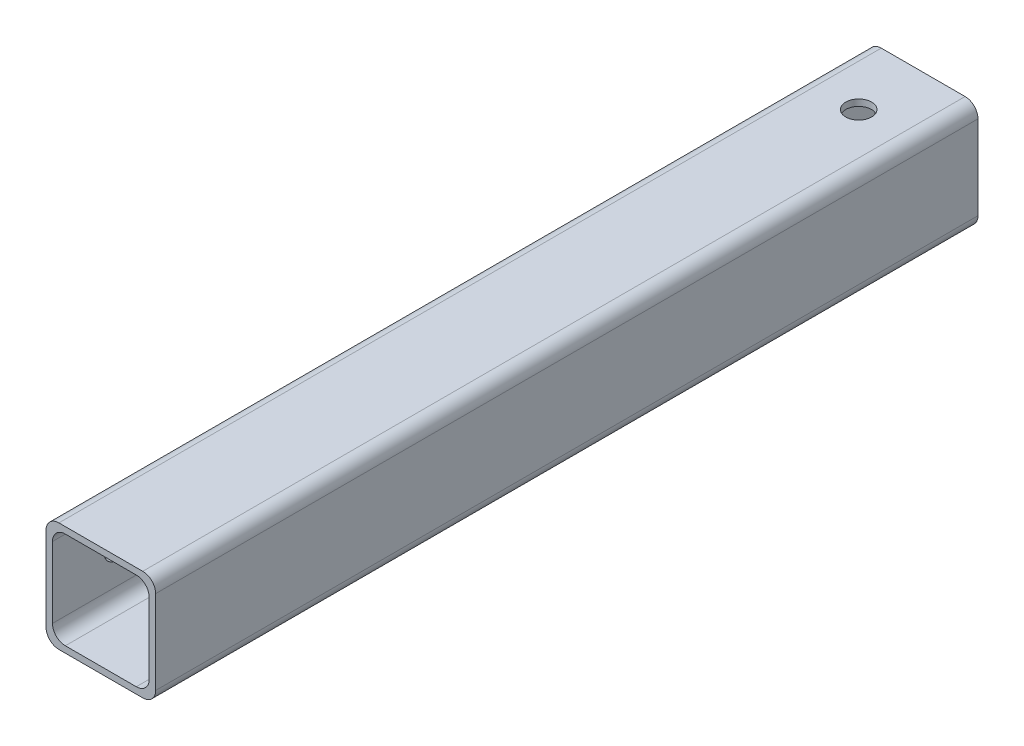
ISO-10303-21;
HEADER;
FILE_DESCRIPTION(('STEP AP214'),'2;1');
FILE_NAME('part.step','',(''),(''),'','','');
FILE_SCHEMA(('AUTOMOTIVE_DESIGN { 1 0 10303 214 1 1 1 1 }'));
ENDSEC;
DATA;
#1=APPLICATION_CONTEXT('core data for automotive mechanical design processes');
#2=APPLICATION_PROTOCOL_DEFINITION('international standard','automotive_design',2000,#1);
#3=PRODUCT_CONTEXT('',#1,'mechanical');
#4=PRODUCT('Part','Part','',(#3));
#5=PRODUCT_RELATED_PRODUCT_CATEGORY('part','',(#4));
#6=PRODUCT_DEFINITION_FORMATION('','',#4);
#7=PRODUCT_DEFINITION_CONTEXT('part definition',#1,'design');
#8=PRODUCT_DEFINITION('design','',#6,#7);
#9=PRODUCT_DEFINITION_SHAPE('','',#8);
#10=(LENGTH_UNIT() NAMED_UNIT(*) SI_UNIT(.MILLI.,.METRE.));
#11=(NAMED_UNIT(*) PLANE_ANGLE_UNIT() SI_UNIT($,.RADIAN.));
#12=(NAMED_UNIT(*) SI_UNIT($,.STERADIAN.) SOLID_ANGLE_UNIT());
#13=UNCERTAINTY_MEASURE_WITH_UNIT(LENGTH_MEASURE(1.E-05),#10,'distance_accuracy_value','');
#14=(GEOMETRIC_REPRESENTATION_CONTEXT(3) GLOBAL_UNCERTAINTY_ASSIGNED_CONTEXT((#13)) GLOBAL_UNIT_ASSIGNED_CONTEXT((#10,
#11,#12)) REPRESENTATION_CONTEXT('',''));
#15=CARTESIAN_POINT('',(0.,0.,0.));
#16=DIRECTION('',(0.,0.,1.));
#17=DIRECTION('',(1.,0.,0.));
#18=AXIS2_PLACEMENT_3D('',#15,#16,#17);
#19=CARTESIAN_POINT('',(0.,0.,161.925));
#20=DIRECTION('',(0.,0.,1.));
#21=DIRECTION('',(1.,0.,0.));
#22=AXIS2_PLACEMENT_3D('',#19,#20,#21);
#23=PLANE('',#22);
#24=DIRECTION('',(0.,1.,0.));
#25=VECTOR('',#24,1.);
#26=CARTESIAN_POINT('',(10.795,-10.795,161.925));
#27=LINE('',#26,#25);
#28=CARTESIAN_POINT('',(10.795,-8.255,161.925));
#29=VERTEX_POINT('',#28);
#30=CARTESIAN_POINT('',(10.795,8.255,161.925));
#31=VERTEX_POINT('',#30);
#32=EDGE_CURVE('E180',#29,#31,#27,.T.);
#33=ORIENTED_EDGE('',*,*,#32,.T.);
#34=CARTESIAN_POINT('',(8.255,8.255,161.925));
#35=DIRECTION('',(0.,0.,1.));
#36=DIRECTION('',(1.,0.,0.));
#37=AXIS2_PLACEMENT_3D('',#34,#35,#36);
#38=CIRCLE('',#37,2.54);
#39=CARTESIAN_POINT('',(8.255,10.795,161.925));
#40=VERTEX_POINT('',#39);
#41=EDGE_CURVE('E222',#31,#40,#38,.T.);
#42=ORIENTED_EDGE('',*,*,#41,.T.);
#43=DIRECTION('',(-1.,0.,0.));
#44=VECTOR('',#43,1.);
#45=CARTESIAN_POINT('',(10.795,10.795,161.925));
#46=LINE('',#45,#44);
#47=CARTESIAN_POINT('',(-8.255,10.795,161.925));
#48=VERTEX_POINT('',#47);
#49=EDGE_CURVE('E175',#40,#48,#46,.T.);
#50=ORIENTED_EDGE('',*,*,#49,.T.);
#51=CARTESIAN_POINT('',(-8.255,8.255,161.925));
#52=DIRECTION('',(0.,0.,1.));
#53=DIRECTION('',(1.,0.,0.));
#54=AXIS2_PLACEMENT_3D('',#51,#52,#53);
#55=CIRCLE('',#54,2.54);
#56=CARTESIAN_POINT('',(-10.795,8.255,161.925));
#57=VERTEX_POINT('',#56);
#58=EDGE_CURVE('E217',#48,#57,#55,.T.);
#59=ORIENTED_EDGE('',*,*,#58,.T.);
#60=DIRECTION('',(0.,-1.,0.));
#61=VECTOR('',#60,1.);
#62=CARTESIAN_POINT('',(-10.795,-10.795,161.925));
#63=LINE('',#62,#61);
#64=CARTESIAN_POINT('',(-10.795,-8.25500000000001,161.925));
#65=VERTEX_POINT('',#64);
#66=EDGE_CURVE('E277',#57,#65,#63,.T.);
#67=ORIENTED_EDGE('',*,*,#66,.T.);
#68=CARTESIAN_POINT('',(-8.255,-8.25500000000001,161.925));
#69=DIRECTION('',(0.,0.,1.));
#70=DIRECTION('',(1.,0.,0.));
#71=AXIS2_PLACEMENT_3D('',#68,#69,#70);
#72=CIRCLE('',#71,2.54);
#73=CARTESIAN_POINT('',(-8.255,-10.795,161.925));
#74=VERTEX_POINT('',#73);
#75=EDGE_CURVE('E57',#65,#74,#72,.T.);
#76=ORIENTED_EDGE('',*,*,#75,.T.);
#77=DIRECTION('',(1.,0.,0.));
#78=VECTOR('',#77,1.);
#79=CARTESIAN_POINT('',(10.795,-10.795,161.925));
#80=LINE('',#79,#78);
#81=CARTESIAN_POINT('',(8.255,-10.795,161.925));
#82=VERTEX_POINT('',#81);
#83=EDGE_CURVE('E279',#74,#82,#80,.T.);
#84=ORIENTED_EDGE('',*,*,#83,.T.);
#85=CARTESIAN_POINT('',(8.255,-8.255,161.925));
#86=DIRECTION('',(0.,0.,1.));
#87=DIRECTION('',(1.,0.,0.));
#88=AXIS2_PLACEMENT_3D('',#85,#86,#87);
#89=CIRCLE('',#88,2.54);
#90=EDGE_CURVE('E220',#82,#29,#89,.T.);
#91=ORIENTED_EDGE('',*,*,#90,.T.);
#92=EDGE_LOOP('',(#33,#42,#50,#59,#67,#76,#84,#91));
#93=FACE_BOUND('',#92,.T.);
#94=DIRECTION('',(1.,0.,0.));
#95=VECTOR('',#94,1.);
#96=CARTESIAN_POINT('',(9.525,-9.525,161.925));
#97=LINE('',#96,#95);
#98=CARTESIAN_POINT('',(-6.985,-9.525,161.925));
#99=VERTEX_POINT('',#98);
#100=CARTESIAN_POINT('',(6.985,-9.525,161.925));
#101=VERTEX_POINT('',#100);
#102=EDGE_CURVE('E259',#99,#101,#97,.T.);
#103=ORIENTED_EDGE('',*,*,#102,.F.);
#104=CARTESIAN_POINT('',(-6.985,-6.985,161.925));
#105=DIRECTION('',(0.,0.,1.));
#106=DIRECTION('',(1.,0.,0.));
#107=AXIS2_PLACEMENT_3D('',#104,#105,#106);
#108=CIRCLE('',#107,2.54);
#109=CARTESIAN_POINT('',(-9.525,-6.985,161.925));
#110=VERTEX_POINT('',#109);
#111=EDGE_CURVE('E160',#99,#110,#108,.F.);
#112=ORIENTED_EDGE('',*,*,#111,.T.);
#113=DIRECTION('',(0.,-1.,0.));
#114=VECTOR('',#113,1.);
#115=CARTESIAN_POINT('',(-9.525,-9.525,161.925));
#116=LINE('',#115,#114);
#117=CARTESIAN_POINT('',(-9.525,6.98499999999999,161.925));
#118=VERTEX_POINT('',#117);
#119=EDGE_CURVE('E265',#118,#110,#116,.T.);
#120=ORIENTED_EDGE('',*,*,#119,.F.);
#121=CARTESIAN_POINT('',(-6.985,6.985,161.925));
#122=DIRECTION('',(0.,0.,1.));
#123=DIRECTION('',(1.,0.,0.));
#124=AXIS2_PLACEMENT_3D('',#121,#122,#123);
#125=CIRCLE('',#124,2.54);
#126=CARTESIAN_POINT('',(-6.985,9.525,161.925));
#127=VERTEX_POINT('',#126);
#128=EDGE_CURVE('E159',#118,#127,#125,.F.);
#129=ORIENTED_EDGE('',*,*,#128,.T.);
#130=DIRECTION('',(-1.,0.,0.));
#131=VECTOR('',#130,1.);
#132=CARTESIAN_POINT('',(9.525,9.525,161.925));
#133=LINE('',#132,#131);
#134=CARTESIAN_POINT('',(6.985,9.525,161.925));
#135=VERTEX_POINT('',#134);
#136=EDGE_CURVE('E267',#135,#127,#133,.T.);
#137=ORIENTED_EDGE('',*,*,#136,.F.);
#138=CARTESIAN_POINT('',(6.985,6.98499999999999,161.925));
#139=DIRECTION('',(0.,0.,1.));
#140=DIRECTION('',(1.,0.,0.));
#141=AXIS2_PLACEMENT_3D('',#138,#139,#140);
#142=CIRCLE('',#141,2.54);
#143=CARTESIAN_POINT('',(9.525,6.98499999999999,161.925));
#144=VERTEX_POINT('',#143);
#145=EDGE_CURVE('E239',#135,#144,#142,.F.);
#146=ORIENTED_EDGE('',*,*,#145,.T.);
#147=DIRECTION('',(0.,1.,0.));
#148=VECTOR('',#147,1.);
#149=CARTESIAN_POINT('',(9.525,-9.525,161.925));
#150=LINE('',#149,#148);
#151=CARTESIAN_POINT('',(9.525,-6.985,161.925));
#152=VERTEX_POINT('',#151);
#153=EDGE_CURVE('E261',#152,#144,#150,.T.);
#154=ORIENTED_EDGE('',*,*,#153,.F.);
#155=CARTESIAN_POINT('',(6.985,-6.985,161.925));
#156=DIRECTION('',(0.,0.,1.));
#157=DIRECTION('',(1.,0.,0.));
#158=AXIS2_PLACEMENT_3D('',#155,#156,#157);
#159=CIRCLE('',#158,2.54);
#160=EDGE_CURVE('E11',#152,#101,#159,.F.);
#161=ORIENTED_EDGE('',*,*,#160,.T.);
#162=EDGE_LOOP('',(#103,#112,#120,#129,#137,#146,#154,#161));
#163=FACE_BOUND('',#162,.T.);
#164=ADVANCED_FACE('F35',(#93,#163),#23,.T.);
#165=CARTESIAN_POINT('',(0.,0.,0.));
#166=DIRECTION('',(0.,0.,1.));
#167=DIRECTION('',(1.,0.,0.));
#168=AXIS2_PLACEMENT_3D('',#165,#166,#167);
#169=PLANE('',#168);
#170=DIRECTION('',(-1.,0.,0.));
#171=VECTOR('',#170,1.);
#172=CARTESIAN_POINT('',(10.795,10.795,0.));
#173=LINE('',#172,#171);
#174=CARTESIAN_POINT('',(8.255,10.795,0.));
#175=VERTEX_POINT('',#174);
#176=CARTESIAN_POINT('',(-8.255,10.795,0.));
#177=VERTEX_POINT('',#176);
#178=EDGE_CURVE('E183',#175,#177,#173,.T.);
#179=ORIENTED_EDGE('',*,*,#178,.F.);
#180=CARTESIAN_POINT('',(8.255,8.255,0.));
#181=DIRECTION('',(0.,0.,1.));
#182=DIRECTION('',(1.,0.,0.));
#183=AXIS2_PLACEMENT_3D('',#180,#181,#182);
#184=CIRCLE('',#183,2.54);
#185=CARTESIAN_POINT('',(10.795,8.255,0.));
#186=VERTEX_POINT('',#185);
#187=EDGE_CURVE('E210',#175,#186,#184,.F.);
#188=ORIENTED_EDGE('',*,*,#187,.T.);
#189=DIRECTION('',(0.,1.,0.));
#190=VECTOR('',#189,1.);
#191=CARTESIAN_POINT('',(10.795,-10.795,0.));
#192=LINE('',#191,#190);
#193=CARTESIAN_POINT('',(10.795,-8.255,0.));
#194=VERTEX_POINT('',#193);
#195=EDGE_CURVE('E286',#194,#186,#192,.T.);
#196=ORIENTED_EDGE('',*,*,#195,.F.);
#197=CARTESIAN_POINT('',(8.255,-8.255,0.));
#198=DIRECTION('',(0.,0.,1.));
#199=DIRECTION('',(1.,0.,0.));
#200=AXIS2_PLACEMENT_3D('',#197,#198,#199);
#201=CIRCLE('',#200,2.54);
#202=CARTESIAN_POINT('',(8.255,-10.795,0.));
#203=VERTEX_POINT('',#202);
#204=EDGE_CURVE('E208',#194,#203,#201,.F.);
#205=ORIENTED_EDGE('',*,*,#204,.T.);
#206=DIRECTION('',(1.,0.,0.));
#207=VECTOR('',#206,1.);
#208=CARTESIAN_POINT('',(10.795,-10.795,0.));
#209=LINE('',#208,#207);
#210=CARTESIAN_POINT('',(-8.255,-10.795,0.));
#211=VERTEX_POINT('',#210);
#212=EDGE_CURVE('E285',#211,#203,#209,.T.);
#213=ORIENTED_EDGE('',*,*,#212,.F.);
#214=CARTESIAN_POINT('',(-8.255,-8.25500000000001,0.));
#215=DIRECTION('',(0.,0.,1.));
#216=DIRECTION('',(1.,0.,0.));
#217=AXIS2_PLACEMENT_3D('',#214,#215,#216);
#218=CIRCLE('',#217,2.54);
#219=CARTESIAN_POINT('',(-10.795,-8.25500000000001,0.));
#220=VERTEX_POINT('',#219);
#221=EDGE_CURVE('E206',#211,#220,#218,.F.);
#222=ORIENTED_EDGE('',*,*,#221,.T.);
#223=DIRECTION('',(0.,-1.,0.));
#224=VECTOR('',#223,1.);
#225=CARTESIAN_POINT('',(-10.795,-10.795,0.));
#226=LINE('',#225,#224);
#227=CARTESIAN_POINT('',(-10.795,8.255,0.));
#228=VERTEX_POINT('',#227);
#229=EDGE_CURVE('E273',#228,#220,#226,.T.);
#230=ORIENTED_EDGE('',*,*,#229,.F.);
#231=CARTESIAN_POINT('',(-8.255,8.255,0.));
#232=DIRECTION('',(0.,0.,1.));
#233=DIRECTION('',(1.,0.,0.));
#234=AXIS2_PLACEMENT_3D('',#231,#232,#233);
#235=CIRCLE('',#234,2.54);
#236=EDGE_CURVE('E204',#228,#177,#235,.F.);
#237=ORIENTED_EDGE('',*,*,#236,.T.);
#238=EDGE_LOOP('',(#179,#188,#196,#205,#213,#222,#230,#237));
#239=FACE_BOUND('',#238,.T.);
#240=DIRECTION('',(-1.,0.,0.));
#241=VECTOR('',#240,1.);
#242=CARTESIAN_POINT('',(9.525,9.525,0.));
#243=LINE('',#242,#241);
#244=CARTESIAN_POINT('',(6.985,9.525,0.));
#245=VERTEX_POINT('',#244);
#246=CARTESIAN_POINT('',(-6.985,9.525,0.));
#247=VERTEX_POINT('',#246);
#248=EDGE_CURVE('E154',#245,#247,#243,.T.);
#249=ORIENTED_EDGE('',*,*,#248,.T.);
#250=CARTESIAN_POINT('',(-6.985,6.985,0.));
#251=DIRECTION('',(0.,0.,1.));
#252=DIRECTION('',(1.,0.,0.));
#253=AXIS2_PLACEMENT_3D('',#250,#251,#252);
#254=CIRCLE('',#253,2.54);
#255=CARTESIAN_POINT('',(-9.525,6.98499999999999,0.));
#256=VERTEX_POINT('',#255);
#257=EDGE_CURVE('E149',#247,#256,#254,.T.);
#258=ORIENTED_EDGE('',*,*,#257,.T.);
#259=DIRECTION('',(0.,-1.,0.));
#260=VECTOR('',#259,1.);
#261=CARTESIAN_POINT('',(-9.525,-9.525,0.));
#262=LINE('',#261,#260);
#263=CARTESIAN_POINT('',(-9.525,-6.985,0.));
#264=VERTEX_POINT('',#263);
#265=EDGE_CURVE('E152',#256,#264,#262,.T.);
#266=ORIENTED_EDGE('',*,*,#265,.T.);
#267=CARTESIAN_POINT('',(-6.985,-6.985,0.));
#268=DIRECTION('',(0.,0.,1.));
#269=DIRECTION('',(1.,0.,0.));
#270=AXIS2_PLACEMENT_3D('',#267,#268,#269);
#271=CIRCLE('',#270,2.54);
#272=CARTESIAN_POINT('',(-6.985,-9.525,0.));
#273=VERTEX_POINT('',#272);
#274=EDGE_CURVE('E233',#264,#273,#271,.T.);
#275=ORIENTED_EDGE('',*,*,#274,.T.);
#276=DIRECTION('',(1.,0.,0.));
#277=VECTOR('',#276,1.);
#278=CARTESIAN_POINT('',(9.525,-9.525,0.));
#279=LINE('',#278,#277);
#280=CARTESIAN_POINT('',(6.985,-9.525,0.));
#281=VERTEX_POINT('',#280);
#282=EDGE_CURVE('E170',#273,#281,#279,.T.);
#283=ORIENTED_EDGE('',*,*,#282,.T.);
#284=CARTESIAN_POINT('',(6.985,-6.985,0.));
#285=DIRECTION('',(0.,0.,1.));
#286=DIRECTION('',(1.,0.,0.));
#287=AXIS2_PLACEMENT_3D('',#284,#285,#286);
#288=CIRCLE('',#287,2.54);
#289=CARTESIAN_POINT('',(9.525,-6.985,0.));
#290=VERTEX_POINT('',#289);
#291=EDGE_CURVE('E43',#281,#290,#288,.T.);
#292=ORIENTED_EDGE('',*,*,#291,.T.);
#293=DIRECTION('',(0.,1.,0.));
#294=VECTOR('',#293,1.);
#295=CARTESIAN_POINT('',(9.525,-9.525,0.));
#296=LINE('',#295,#294);
#297=CARTESIAN_POINT('',(9.525,6.98499999999999,0.));
#298=VERTEX_POINT('',#297);
#299=EDGE_CURVE('E243',#290,#298,#296,.T.);
#300=ORIENTED_EDGE('',*,*,#299,.T.);
#301=CARTESIAN_POINT('',(6.985,6.98499999999999,0.));
#302=DIRECTION('',(0.,0.,1.));
#303=DIRECTION('',(1.,0.,0.));
#304=AXIS2_PLACEMENT_3D('',#301,#302,#303);
#305=CIRCLE('',#304,2.54);
#306=EDGE_CURVE('E237',#298,#245,#305,.T.);
#307=ORIENTED_EDGE('',*,*,#306,.T.);
#308=EDGE_LOOP('',(#249,#258,#266,#275,#283,#292,#300,#307));
#309=FACE_BOUND('',#308,.T.);
#310=ADVANCED_FACE('F151',(#239,#309),#169,.F.);
#311=CARTESIAN_POINT('',(-10.795,-10.795,161.925));
#312=DIRECTION('',(1.,0.,0.));
#313=DIRECTION('',(0.,0.,-1.));
#314=AXIS2_PLACEMENT_3D('',#311,#312,#313);
#315=PLANE('',#314);
#316=CARTESIAN_POINT('',(-10.795,0.,149.225));
#317=DIRECTION('',(-1.,0.,0.));
#318=DIRECTION('',(0.,0.,1.));
#319=AXIS2_PLACEMENT_3D('',#316,#317,#318);
#320=CIRCLE('',#319,2.55269999999999);
#321=CARTESIAN_POINT('',(-10.795,0.,151.7777));
#322=VERTEX_POINT('',#321);
#323=EDGE_CURVE('E387',#322,#322,#320,.T.);
#324=ORIENTED_EDGE('',*,*,#323,.F.);
#325=EDGE_LOOP('',(#324));
#326=FACE_BOUND('',#325,.T.);
#327=ORIENTED_EDGE('',*,*,#229,.T.);
#328=DIRECTION('',(0.,0.,-1.));
#329=VECTOR('',#328,1.);
#330=CARTESIAN_POINT('',(-10.795,-8.25500000000001,161.925));
#331=LINE('',#330,#329);
#332=EDGE_CURVE('E231',#220,#65,#331,.F.);
#333=ORIENTED_EDGE('',*,*,#332,.T.);
#334=ORIENTED_EDGE('',*,*,#66,.F.);
#335=DIRECTION('',(0.,0.,-1.));
#336=VECTOR('',#335,1.);
#337=CARTESIAN_POINT('',(-10.795,8.255,161.925));
#338=LINE('',#337,#336);
#339=EDGE_CURVE('E228',#57,#228,#338,.T.);
#340=ORIENTED_EDGE('',*,*,#339,.T.);
#341=EDGE_LOOP('',(#327,#333,#334,#340));
#342=FACE_BOUND('',#341,.T.);
#343=ADVANCED_FACE('F304',(#326,#342),#315,.F.);
#344=CARTESIAN_POINT('',(10.795,-10.795,161.925));
#345=DIRECTION('',(0.,1.,0.));
#346=DIRECTION('',(-1.,0.,0.));
#347=AXIS2_PLACEMENT_3D('',#344,#345,#346);
#348=PLANE('',#347);
#349=ORIENTED_EDGE('',*,*,#212,.T.);
#350=DIRECTION('',(0.,0.,-1.));
#351=VECTOR('',#350,1.);
#352=CARTESIAN_POINT('',(8.255,-10.795,161.925));
#353=LINE('',#352,#351);
#354=EDGE_CURVE('E50',#203,#82,#353,.F.);
#355=ORIENTED_EDGE('',*,*,#354,.T.);
#356=ORIENTED_EDGE('',*,*,#83,.F.);
#357=DIRECTION('',(0.,0.,-1.));
#358=VECTOR('',#357,1.);
#359=CARTESIAN_POINT('',(-8.255,-10.795,161.925));
#360=LINE('',#359,#358);
#361=EDGE_CURVE('E224',#74,#211,#360,.T.);
#362=ORIENTED_EDGE('',*,*,#361,.T.);
#363=EDGE_LOOP('',(#349,#355,#356,#362));
#364=FACE_BOUND('',#363,.T.);
#365=ADVANCED_FACE('F311',(#364),#348,.F.);
#366=CARTESIAN_POINT('',(10.795,-10.795,161.925));
#367=DIRECTION('',(-1.,0.,0.));
#368=DIRECTION('',(0.,0.,1.));
#369=AXIS2_PLACEMENT_3D('',#366,#367,#368);
#370=PLANE('',#369);
#371=ORIENTED_EDGE('',*,*,#195,.T.);
#372=DIRECTION('',(0.,0.,-1.));
#373=VECTOR('',#372,1.);
#374=CARTESIAN_POINT('',(10.795,8.255,161.925));
#375=LINE('',#374,#373);
#376=EDGE_CURVE('E215',#186,#31,#375,.F.);
#377=ORIENTED_EDGE('',*,*,#376,.T.);
#378=ORIENTED_EDGE('',*,*,#32,.F.);
#379=DIRECTION('',(0.,0.,-1.));
#380=VECTOR('',#379,1.);
#381=CARTESIAN_POINT('',(10.795,-8.255,161.925));
#382=LINE('',#381,#380);
#383=EDGE_CURVE('E212',#29,#194,#382,.T.);
#384=ORIENTED_EDGE('',*,*,#383,.T.);
#385=EDGE_LOOP('',(#371,#377,#378,#384));
#386=FACE_BOUND('',#385,.T.);
#387=ADVANCED_FACE('F317',(#386),#370,.F.);
#388=CARTESIAN_POINT('',(10.795,10.795,161.925));
#389=DIRECTION('',(0.,-1.,0.));
#390=DIRECTION('',(1.,0.,0.));
#391=AXIS2_PLACEMENT_3D('',#388,#389,#390);
#392=PLANE('',#391);
#393=CARTESIAN_POINT('',(0.,10.795,12.7));
#394=DIRECTION('',(0.,1.,0.));
#395=DIRECTION('',(0.,0.,1.));
#396=AXIS2_PLACEMENT_3D('',#393,#394,#395);
#397=CIRCLE('',#396,2.5527);
#398=CARTESIAN_POINT('',(0.,10.795,15.2527));
#399=VERTEX_POINT('',#398);
#400=EDGE_CURVE('E386',#399,#399,#397,.T.);
#401=ORIENTED_EDGE('',*,*,#400,.F.);
#402=EDGE_LOOP('',(#401));
#403=FACE_BOUND('',#402,.T.);
#404=ORIENTED_EDGE('',*,*,#49,.F.);
#405=DIRECTION('',(0.,0.,-1.));
#406=VECTOR('',#405,1.);
#407=CARTESIAN_POINT('',(8.255,10.795,161.925));
#408=LINE('',#407,#406);
#409=EDGE_CURVE('E201',#40,#175,#408,.T.);
#410=ORIENTED_EDGE('',*,*,#409,.T.);
#411=ORIENTED_EDGE('',*,*,#178,.T.);
#412=DIRECTION('',(0.,0.,-1.));
#413=VECTOR('',#412,1.);
#414=CARTESIAN_POINT('',(-8.255,10.795,161.925));
#415=LINE('',#414,#413);
#416=EDGE_CURVE('E199',#177,#48,#415,.F.);
#417=ORIENTED_EDGE('',*,*,#416,.T.);
#418=EDGE_LOOP('',(#404,#410,#411,#417));
#419=FACE_BOUND('',#418,.T.);
#420=ADVANCED_FACE('F296',(#403,#419),#392,.F.);
#421=CARTESIAN_POINT('',(-9.525,-9.525,161.925));
#422=DIRECTION('',(1.,0.,0.));
#423=DIRECTION('',(0.,0.,-1.));
#424=AXIS2_PLACEMENT_3D('',#421,#422,#423);
#425=PLANE('',#424);
#426=CARTESIAN_POINT('',(-9.525,0.,149.225));
#427=DIRECTION('',(1.,0.,0.));
#428=DIRECTION('',(0.,0.,-1.));
#429=AXIS2_PLACEMENT_3D('',#426,#427,#428);
#430=CIRCLE('',#429,2.55269999999999);
#431=CARTESIAN_POINT('',(-9.525,0.,146.6723));
#432=VERTEX_POINT('',#431);
#433=EDGE_CURVE('E384',#432,#432,#430,.T.);
#434=ORIENTED_EDGE('',*,*,#433,.F.);
#435=EDGE_LOOP('',(#434));
#436=FACE_BOUND('',#435,.T.);
#437=ORIENTED_EDGE('',*,*,#119,.T.);
#438=DIRECTION('',(0.,0.,-1.));
#439=VECTOR('',#438,1.);
#440=CARTESIAN_POINT('',(-9.525,-6.985,0.));
#441=LINE('',#440,#439);
#442=EDGE_CURVE('E169',#110,#264,#441,.T.);
#443=ORIENTED_EDGE('',*,*,#442,.T.);
#444=ORIENTED_EDGE('',*,*,#265,.F.);
#445=DIRECTION('',(0.,0.,-1.));
#446=VECTOR('',#445,1.);
#447=CARTESIAN_POINT('',(-9.525,6.985,161.925));
#448=LINE('',#447,#446);
#449=EDGE_CURVE('E166',#256,#118,#448,.F.);
#450=ORIENTED_EDGE('',*,*,#449,.T.);
#451=EDGE_LOOP('',(#437,#443,#444,#450));
#452=FACE_BOUND('',#451,.T.);
#453=ADVANCED_FACE('F165',(#436,#452),#425,.T.);
#454=CARTESIAN_POINT('',(9.525,-9.525,161.925));
#455=DIRECTION('',(0.,1.,0.));
#456=DIRECTION('',(0.,0.,1.));
#457=AXIS2_PLACEMENT_3D('',#454,#455,#456);
#458=PLANE('',#457);
#459=ORIENTED_EDGE('',*,*,#282,.F.);
#460=DIRECTION('',(0.,0.,-1.));
#461=VECTOR('',#460,1.);
#462=CARTESIAN_POINT('',(-6.985,-9.525,161.925));
#463=LINE('',#462,#461);
#464=EDGE_CURVE('E188',#273,#99,#463,.F.);
#465=ORIENTED_EDGE('',*,*,#464,.T.);
#466=ORIENTED_EDGE('',*,*,#102,.T.);
#467=DIRECTION('',(0.,0.,-1.));
#468=VECTOR('',#467,1.);
#469=CARTESIAN_POINT('',(6.985,-9.525,0.));
#470=LINE('',#469,#468);
#471=EDGE_CURVE('E177',#101,#281,#470,.T.);
#472=ORIENTED_EDGE('',*,*,#471,.T.);
#473=EDGE_LOOP('',(#459,#465,#466,#472));
#474=FACE_BOUND('',#473,.T.);
#475=ADVANCED_FACE('F263',(#474),#458,.T.);
#476=CARTESIAN_POINT('',(9.525,-9.525,161.925));
#477=DIRECTION('',(-1.,0.,0.));
#478=DIRECTION('',(0.,0.,1.));
#479=AXIS2_PLACEMENT_3D('',#476,#477,#478);
#480=PLANE('',#479);
#481=ORIENTED_EDGE('',*,*,#153,.T.);
#482=DIRECTION('',(0.,0.,-1.));
#483=VECTOR('',#482,1.);
#484=CARTESIAN_POINT('',(9.525,6.98499999999999,0.));
#485=LINE('',#484,#483);
#486=EDGE_CURVE('E196',#144,#298,#485,.T.);
#487=ORIENTED_EDGE('',*,*,#486,.T.);
#488=ORIENTED_EDGE('',*,*,#299,.F.);
#489=DIRECTION('',(0.,0.,-1.));
#490=VECTOR('',#489,1.);
#491=CARTESIAN_POINT('',(9.525,-6.985,161.925));
#492=LINE('',#491,#490);
#493=EDGE_CURVE('E194',#290,#152,#492,.F.);
#494=ORIENTED_EDGE('',*,*,#493,.T.);
#495=EDGE_LOOP('',(#481,#487,#488,#494));
#496=FACE_BOUND('',#495,.T.);
#497=ADVANCED_FACE('F250',(#496),#480,.T.);
#498=CARTESIAN_POINT('',(9.525,9.525,161.925));
#499=DIRECTION('',(0.,-1.,0.));
#500=DIRECTION('',(0.,0.,-1.));
#501=AXIS2_PLACEMENT_3D('',#498,#499,#500);
#502=PLANE('',#501);
#503=CARTESIAN_POINT('',(0.,9.525,12.7));
#504=DIRECTION('',(0.,-1.,0.));
#505=DIRECTION('',(0.,0.,-1.));
#506=AXIS2_PLACEMENT_3D('',#503,#504,#505);
#507=CIRCLE('',#506,2.5527);
#508=CARTESIAN_POINT('',(0.,9.525,10.1473));
#509=VERTEX_POINT('',#508);
#510=EDGE_CURVE('E171',#509,#509,#507,.T.);
#511=ORIENTED_EDGE('',*,*,#510,.F.);
#512=EDGE_LOOP('',(#511));
#513=FACE_BOUND('',#512,.T.);
#514=ORIENTED_EDGE('',*,*,#136,.T.);
#515=DIRECTION('',(0.,0.,-1.));
#516=VECTOR('',#515,1.);
#517=CARTESIAN_POINT('',(-6.985,9.525,0.));
#518=LINE('',#517,#516);
#519=EDGE_CURVE('E192',#127,#247,#518,.T.);
#520=ORIENTED_EDGE('',*,*,#519,.T.);
#521=ORIENTED_EDGE('',*,*,#248,.F.);
#522=DIRECTION('',(0.,0.,-1.));
#523=VECTOR('',#522,1.);
#524=CARTESIAN_POINT('',(6.985,9.525,161.925));
#525=LINE('',#524,#523);
#526=EDGE_CURVE('E190',#245,#135,#525,.F.);
#527=ORIENTED_EDGE('',*,*,#526,.T.);
#528=EDGE_LOOP('',(#514,#520,#521,#527));
#529=FACE_BOUND('',#528,.T.);
#530=ADVANCED_FACE('F352',(#513,#529),#502,.T.);
#531=CARTESIAN_POINT('',(-6.985,-6.985,161.925));
#532=DIRECTION('',(0.,0.,1.));
#533=DIRECTION('',(1.,0.,0.));
#534=AXIS2_PLACEMENT_3D('',#531,#532,#533);
#535=CYLINDRICAL_SURFACE('',#534,2.54);
#536=ORIENTED_EDGE('',*,*,#111,.F.);
#537=ORIENTED_EDGE('',*,*,#464,.F.);
#538=ORIENTED_EDGE('',*,*,#274,.F.);
#539=ORIENTED_EDGE('',*,*,#442,.F.);
#540=EDGE_LOOP('',(#536,#537,#538,#539));
#541=FACE_BOUND('',#540,.T.);
#542=ADVANCED_FACE('F349',(#541),#535,.F.);
#543=CARTESIAN_POINT('',(-6.985,6.985,161.925));
#544=DIRECTION('',(0.,0.,1.));
#545=DIRECTION('',(1.,0.,0.));
#546=AXIS2_PLACEMENT_3D('',#543,#544,#545);
#547=CYLINDRICAL_SURFACE('',#546,2.54);
#548=ORIENTED_EDGE('',*,*,#128,.F.);
#549=ORIENTED_EDGE('',*,*,#449,.F.);
#550=ORIENTED_EDGE('',*,*,#257,.F.);
#551=ORIENTED_EDGE('',*,*,#519,.F.);
#552=EDGE_LOOP('',(#548,#549,#550,#551));
#553=FACE_BOUND('',#552,.T.);
#554=ADVANCED_FACE('F174',(#553),#547,.F.);
#555=CARTESIAN_POINT('',(6.985,6.98499999999999,161.925));
#556=DIRECTION('',(0.,0.,1.));
#557=DIRECTION('',(1.,0.,0.));
#558=AXIS2_PLACEMENT_3D('',#555,#556,#557);
#559=CYLINDRICAL_SURFACE('',#558,2.54);
#560=ORIENTED_EDGE('',*,*,#145,.F.);
#561=ORIENTED_EDGE('',*,*,#526,.F.);
#562=ORIENTED_EDGE('',*,*,#306,.F.);
#563=ORIENTED_EDGE('',*,*,#486,.F.);
#564=EDGE_LOOP('',(#560,#561,#562,#563));
#565=FACE_BOUND('',#564,.T.);
#566=ADVANCED_FACE('F328',(#565),#559,.F.);
#567=CARTESIAN_POINT('',(6.985,-6.985,161.925));
#568=DIRECTION('',(0.,0.,1.));
#569=DIRECTION('',(1.,0.,0.));
#570=AXIS2_PLACEMENT_3D('',#567,#568,#569);
#571=CYLINDRICAL_SURFACE('',#570,2.54);
#572=ORIENTED_EDGE('',*,*,#160,.F.);
#573=ORIENTED_EDGE('',*,*,#493,.F.);
#574=ORIENTED_EDGE('',*,*,#291,.F.);
#575=ORIENTED_EDGE('',*,*,#471,.F.);
#576=EDGE_LOOP('',(#572,#573,#574,#575));
#577=FACE_BOUND('',#576,.T.);
#578=ADVANCED_FACE('F255',(#577),#571,.F.);
#579=CARTESIAN_POINT('',(8.255,8.255,161.925));
#580=DIRECTION('',(0.,0.,-1.));
#581=DIRECTION('',(-1.,0.,0.));
#582=AXIS2_PLACEMENT_3D('',#579,#580,#581);
#583=CYLINDRICAL_SURFACE('',#582,2.54);
#584=ORIENTED_EDGE('',*,*,#41,.F.);
#585=ORIENTED_EDGE('',*,*,#376,.F.);
#586=ORIENTED_EDGE('',*,*,#187,.F.);
#587=ORIENTED_EDGE('',*,*,#409,.F.);
#588=EDGE_LOOP('',(#584,#585,#586,#587));
#589=FACE_BOUND('',#588,.T.);
#590=ADVANCED_FACE('F320',(#589),#583,.T.);
#591=CARTESIAN_POINT('',(8.255,-8.255,161.925));
#592=DIRECTION('',(0.,0.,-1.));
#593=DIRECTION('',(-1.,0.,0.));
#594=AXIS2_PLACEMENT_3D('',#591,#592,#593);
#595=CYLINDRICAL_SURFACE('',#594,2.54);
#596=ORIENTED_EDGE('',*,*,#90,.F.);
#597=ORIENTED_EDGE('',*,*,#354,.F.);
#598=ORIENTED_EDGE('',*,*,#204,.F.);
#599=ORIENTED_EDGE('',*,*,#383,.F.);
#600=EDGE_LOOP('',(#596,#597,#598,#599));
#601=FACE_BOUND('',#600,.T.);
#602=ADVANCED_FACE('F315',(#601),#595,.T.);
#603=CARTESIAN_POINT('',(-8.255,-8.25500000000001,161.925));
#604=DIRECTION('',(0.,0.,-1.));
#605=DIRECTION('',(-1.,0.,0.));
#606=AXIS2_PLACEMENT_3D('',#603,#604,#605);
#607=CYLINDRICAL_SURFACE('',#606,2.54);
#608=ORIENTED_EDGE('',*,*,#75,.F.);
#609=ORIENTED_EDGE('',*,*,#332,.F.);
#610=ORIENTED_EDGE('',*,*,#221,.F.);
#611=ORIENTED_EDGE('',*,*,#361,.F.);
#612=EDGE_LOOP('',(#608,#609,#610,#611));
#613=FACE_BOUND('',#612,.T.);
#614=ADVANCED_FACE('F308',(#613),#607,.T.);
#615=CARTESIAN_POINT('',(-8.255,8.255,161.925));
#616=DIRECTION('',(0.,0.,-1.));
#617=DIRECTION('',(-1.,0.,0.));
#618=AXIS2_PLACEMENT_3D('',#615,#616,#617);
#619=CYLINDRICAL_SURFACE('',#618,2.54);
#620=ORIENTED_EDGE('',*,*,#58,.F.);
#621=ORIENTED_EDGE('',*,*,#416,.F.);
#622=ORIENTED_EDGE('',*,*,#236,.F.);
#623=ORIENTED_EDGE('',*,*,#339,.F.);
#624=EDGE_LOOP('',(#620,#621,#622,#623));
#625=FACE_BOUND('',#624,.T.);
#626=ADVANCED_FACE('F37',(#625),#619,.T.);
#627=CARTESIAN_POINT('',(0.,10.795,12.7));
#628=DIRECTION('',(0.,1.,0.));
#629=DIRECTION('',(0.,0.,1.));
#630=AXIS2_PLACEMENT_3D('',#627,#628,#629);
#631=CYLINDRICAL_SURFACE('',#630,2.5527);
#632=ORIENTED_EDGE('',*,*,#510,.T.);
#633=EDGE_LOOP('',(#632));
#634=FACE_BOUND('',#633,.T.);
#635=ORIENTED_EDGE('',*,*,#400,.T.);
#636=EDGE_LOOP('',(#635));
#637=FACE_BOUND('',#636,.T.);
#638=ADVANCED_FACE('F373',(#634,#637),#631,.F.);
#639=CARTESIAN_POINT('',(-10.795,0.,149.225));
#640=DIRECTION('',(-1.,0.,0.));
#641=DIRECTION('',(0.,0.,1.));
#642=AXIS2_PLACEMENT_3D('',#639,#640,#641);
#643=CYLINDRICAL_SURFACE('',#642,2.55269999999999);
#644=ORIENTED_EDGE('',*,*,#433,.T.);
#645=EDGE_LOOP('',(#644));
#646=FACE_BOUND('',#645,.T.);
#647=ORIENTED_EDGE('',*,*,#323,.T.);
#648=EDGE_LOOP('',(#647));
#649=FACE_BOUND('',#648,.T.);
#650=ADVANCED_FACE('F397',(#646,#649),#643,.F.);
#651=CLOSED_SHELL('',(#164,#310,#343,#365,#387,#420,#453,#475,#497,#530,#542,#554,#566,#578,
#590,#602,#614,#626,#638,#650));
#652=MANIFOLD_SOLID_BREP('B2',#651);
#653=ADVANCED_BREP_SHAPE_REPRESENTATION('',(#18,#652),#14);
#654=SHAPE_DEFINITION_REPRESENTATION(#9,#653);
ENDSEC;
END-ISO-10303-21;
